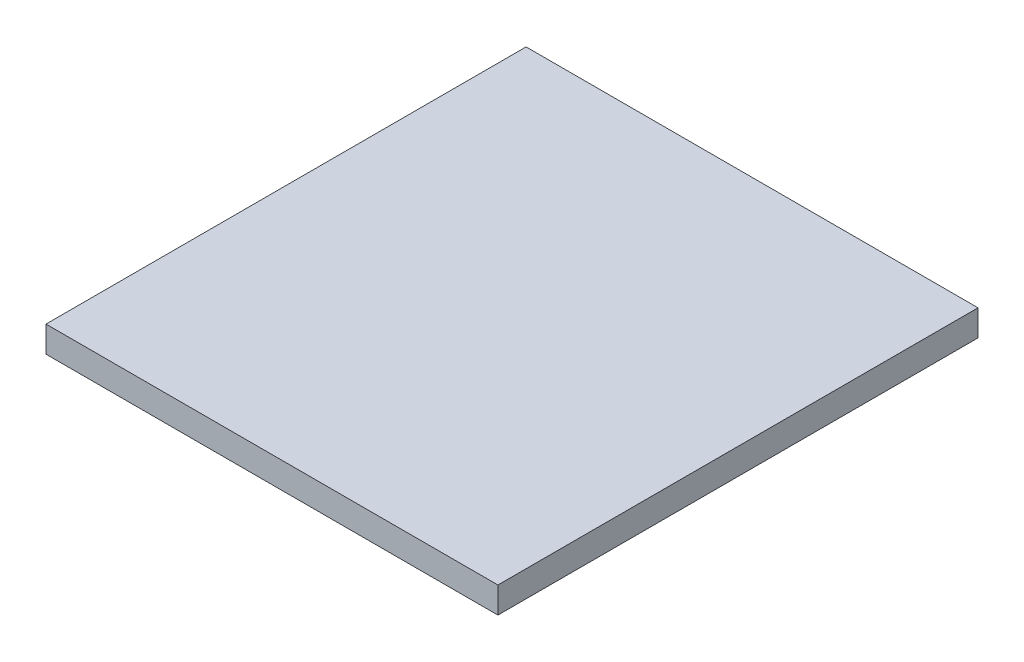
ISO-10303-21;
HEADER;
FILE_DESCRIPTION(('STEP AP214'),'2;1');
FILE_NAME('part.step','',(''),(''),'','','');
FILE_SCHEMA(('AUTOMOTIVE_DESIGN { 1 0 10303 214 1 1 1 1 }'));
ENDSEC;
DATA;
#1=APPLICATION_CONTEXT('core data for automotive mechanical design processes');
#2=APPLICATION_PROTOCOL_DEFINITION('international standard','automotive_design',2000,#1);
#3=PRODUCT_CONTEXT('',#1,'mechanical');
#4=PRODUCT('Part','Part','',(#3));
#5=PRODUCT_RELATED_PRODUCT_CATEGORY('part','',(#4));
#6=PRODUCT_DEFINITION_FORMATION('','',#4);
#7=PRODUCT_DEFINITION_CONTEXT('part definition',#1,'design');
#8=PRODUCT_DEFINITION('design','',#6,#7);
#9=PRODUCT_DEFINITION_SHAPE('','',#8);
#10=(LENGTH_UNIT() NAMED_UNIT(*) SI_UNIT(.MILLI.,.METRE.));
#11=(NAMED_UNIT(*) PLANE_ANGLE_UNIT() SI_UNIT($,.RADIAN.));
#12=(NAMED_UNIT(*) SI_UNIT($,.STERADIAN.) SOLID_ANGLE_UNIT());
#13=UNCERTAINTY_MEASURE_WITH_UNIT(LENGTH_MEASURE(1.E-05),#10,'distance_accuracy_value','');
#14=(GEOMETRIC_REPRESENTATION_CONTEXT(3) GLOBAL_UNCERTAINTY_ASSIGNED_CONTEXT((#13)) GLOBAL_UNIT_ASSIGNED_CONTEXT((#10,
#11,#12)) REPRESENTATION_CONTEXT('',''));
#15=CARTESIAN_POINT('',(0.,0.,0.));
#16=DIRECTION('',(0.,0.,1.));
#17=DIRECTION('',(1.,0.,0.));
#18=AXIS2_PLACEMENT_3D('',#15,#16,#17);
#19=CARTESIAN_POINT('',(54.991,3.175,58.42));
#20=DIRECTION('',(-1.,0.,0.));
#21=DIRECTION('',(0.,0.,1.));
#22=AXIS2_PLACEMENT_3D('',#19,#20,#21);
#23=PLANE('',#22);
#24=DIRECTION('',(0.,0.,-1.));
#25=VECTOR('',#24,1.);
#26=CARTESIAN_POINT('',(54.991,-3.175,58.42));
#27=LINE('',#26,#25);
#28=CARTESIAN_POINT('',(54.991,-3.175,58.42));
#29=VERTEX_POINT('',#28);
#30=CARTESIAN_POINT('',(54.991,-3.175,-58.42));
#31=VERTEX_POINT('',#30);
#32=EDGE_CURVE('E95',#29,#31,#27,.T.);
#33=ORIENTED_EDGE('',*,*,#32,.T.);
#34=DIRECTION('',(0.,-1.,0.));
#35=VECTOR('',#34,1.);
#36=CARTESIAN_POINT('',(54.991,3.175,-58.42));
#37=LINE('',#36,#35);
#38=CARTESIAN_POINT('',(54.991,3.175,-58.42));
#39=VERTEX_POINT('',#38);
#40=EDGE_CURVE('E11',#39,#31,#37,.T.);
#41=ORIENTED_EDGE('',*,*,#40,.F.);
#42=DIRECTION('',(0.,0.,-1.));
#43=VECTOR('',#42,1.);
#44=CARTESIAN_POINT('',(54.991,3.175,58.42));
#45=LINE('',#44,#43);
#46=CARTESIAN_POINT('',(54.991,3.175,58.42));
#47=VERTEX_POINT('',#46);
#48=EDGE_CURVE('E83',#47,#39,#45,.T.);
#49=ORIENTED_EDGE('',*,*,#48,.F.);
#50=DIRECTION('',(0.,-1.,0.));
#51=VECTOR('',#50,1.);
#52=CARTESIAN_POINT('',(54.991,3.175,58.42));
#53=LINE('',#52,#51);
#54=EDGE_CURVE('E91',#47,#29,#53,.T.);
#55=ORIENTED_EDGE('',*,*,#54,.T.);
#56=EDGE_LOOP('',(#33,#41,#49,#55));
#57=FACE_BOUND('',#56,.T.);
#58=ADVANCED_FACE('F32',(#57),#23,.F.);
#59=CARTESIAN_POINT('',(-54.991,3.175,-58.42));
#60=DIRECTION('',(0.,0.,1.));
#61=DIRECTION('',(1.,0.,0.));
#62=AXIS2_PLACEMENT_3D('',#59,#60,#61);
#63=PLANE('',#62);
#64=DIRECTION('',(-1.,0.,0.));
#65=VECTOR('',#64,1.);
#66=CARTESIAN_POINT('',(-54.991,-3.175,-58.42));
#67=LINE('',#66,#65);
#68=CARTESIAN_POINT('',(-54.991,-3.175,-58.42));
#69=VERTEX_POINT('',#68);
#70=EDGE_CURVE('E87',#31,#69,#67,.T.);
#71=ORIENTED_EDGE('',*,*,#70,.T.);
#72=DIRECTION('',(0.,-1.,0.));
#73=VECTOR('',#72,1.);
#74=CARTESIAN_POINT('',(-54.991,3.175,-58.42));
#75=LINE('',#74,#73);
#76=CARTESIAN_POINT('',(-54.991,3.175,-58.42));
#77=VERTEX_POINT('',#76);
#78=EDGE_CURVE('E40',#77,#69,#75,.T.);
#79=ORIENTED_EDGE('',*,*,#78,.F.);
#80=DIRECTION('',(-1.,0.,0.));
#81=VECTOR('',#80,1.);
#82=CARTESIAN_POINT('',(-54.991,3.175,-58.42));
#83=LINE('',#82,#81);
#84=EDGE_CURVE('E78',#39,#77,#83,.T.);
#85=ORIENTED_EDGE('',*,*,#84,.F.);
#86=ORIENTED_EDGE('',*,*,#40,.T.);
#87=EDGE_LOOP('',(#71,#79,#85,#86));
#88=FACE_BOUND('',#87,.T.);
#89=ADVANCED_FACE('F86',(#88),#63,.F.);
#90=CARTESIAN_POINT('',(-54.991,3.175,58.42));
#91=DIRECTION('',(1.,0.,0.));
#92=DIRECTION('',(0.,0.,-1.));
#93=AXIS2_PLACEMENT_3D('',#90,#91,#92);
#94=PLANE('',#93);
#95=DIRECTION('',(0.,0.,1.));
#96=VECTOR('',#95,1.);
#97=CARTESIAN_POINT('',(-54.991,-3.175,58.42));
#98=LINE('',#97,#96);
#99=CARTESIAN_POINT('',(-54.991,-3.175,58.42));
#100=VERTEX_POINT('',#99);
#101=EDGE_CURVE('E65',#69,#100,#98,.T.);
#102=ORIENTED_EDGE('',*,*,#101,.T.);
#103=DIRECTION('',(0.,-1.,0.));
#104=VECTOR('',#103,1.);
#105=CARTESIAN_POINT('',(-54.991,3.175,58.42));
#106=LINE('',#105,#104);
#107=CARTESIAN_POINT('',(-54.991,3.175,58.42));
#108=VERTEX_POINT('',#107);
#109=EDGE_CURVE('E88',#108,#100,#106,.T.);
#110=ORIENTED_EDGE('',*,*,#109,.F.);
#111=DIRECTION('',(0.,0.,1.));
#112=VECTOR('',#111,1.);
#113=CARTESIAN_POINT('',(-54.991,3.175,58.42));
#114=LINE('',#113,#112);
#115=EDGE_CURVE('E81',#77,#108,#114,.T.);
#116=ORIENTED_EDGE('',*,*,#115,.F.);
#117=ORIENTED_EDGE('',*,*,#78,.T.);
#118=EDGE_LOOP('',(#102,#110,#116,#117));
#119=FACE_BOUND('',#118,.T.);
#120=ADVANCED_FACE('F89',(#119),#94,.F.);
#121=CARTESIAN_POINT('',(-54.991,3.175,58.42));
#122=DIRECTION('',(0.,0.,-1.));
#123=DIRECTION('',(-1.,0.,0.));
#124=AXIS2_PLACEMENT_3D('',#121,#122,#123);
#125=PLANE('',#124);
#126=DIRECTION('',(1.,0.,0.));
#127=VECTOR('',#126,1.);
#128=CARTESIAN_POINT('',(-54.991,-3.175,58.42));
#129=LINE('',#128,#127);
#130=EDGE_CURVE('E71',#100,#29,#129,.T.);
#131=ORIENTED_EDGE('',*,*,#130,.T.);
#132=ORIENTED_EDGE('',*,*,#54,.F.);
#133=DIRECTION('',(1.,0.,0.));
#134=VECTOR('',#133,1.);
#135=CARTESIAN_POINT('',(-54.991,3.175,58.42));
#136=LINE('',#135,#134);
#137=EDGE_CURVE('E48',#108,#47,#136,.T.);
#138=ORIENTED_EDGE('',*,*,#137,.F.);
#139=ORIENTED_EDGE('',*,*,#109,.T.);
#140=EDGE_LOOP('',(#131,#132,#138,#139));
#141=FACE_BOUND('',#140,.T.);
#142=ADVANCED_FACE('F102',(#141),#125,.F.);
#143=CARTESIAN_POINT('',(54.991,3.175,-58.42));
#144=DIRECTION('',(0.,-1.,0.));
#145=DIRECTION('',(0.,0.,-1.));
#146=AXIS2_PLACEMENT_3D('',#143,#144,#145);
#147=PLANE('',#146);
#148=ORIENTED_EDGE('',*,*,#48,.T.);
#149=ORIENTED_EDGE('',*,*,#84,.T.);
#150=ORIENTED_EDGE('',*,*,#115,.T.);
#151=ORIENTED_EDGE('',*,*,#137,.T.);
#152=EDGE_LOOP('',(#148,#149,#150,#151));
#153=FACE_BOUND('',#152,.T.);
#154=ADVANCED_FACE('F79',(#153),#147,.F.);
#155=CARTESIAN_POINT('',(54.991,-3.175,-58.42));
#156=DIRECTION('',(0.,-1.,0.));
#157=DIRECTION('',(0.,0.,-1.));
#158=AXIS2_PLACEMENT_3D('',#155,#156,#157);
#159=PLANE('',#158);
#160=ORIENTED_EDGE('',*,*,#32,.F.);
#161=ORIENTED_EDGE('',*,*,#130,.F.);
#162=ORIENTED_EDGE('',*,*,#101,.F.);
#163=ORIENTED_EDGE('',*,*,#70,.F.);
#164=EDGE_LOOP('',(#160,#161,#162,#163));
#165=FACE_BOUND('',#164,.T.);
#166=ADVANCED_FACE('F105',(#165),#159,.T.);
#167=CLOSED_SHELL('',(#58,#89,#120,#142,#154,#166));
#168=MANIFOLD_SOLID_BREP('B2',#167);
#169=ADVANCED_BREP_SHAPE_REPRESENTATION('',(#18,#168),#14);
#170=SHAPE_DEFINITION_REPRESENTATION(#9,#169);
ENDSEC;
END-ISO-10303-21;
